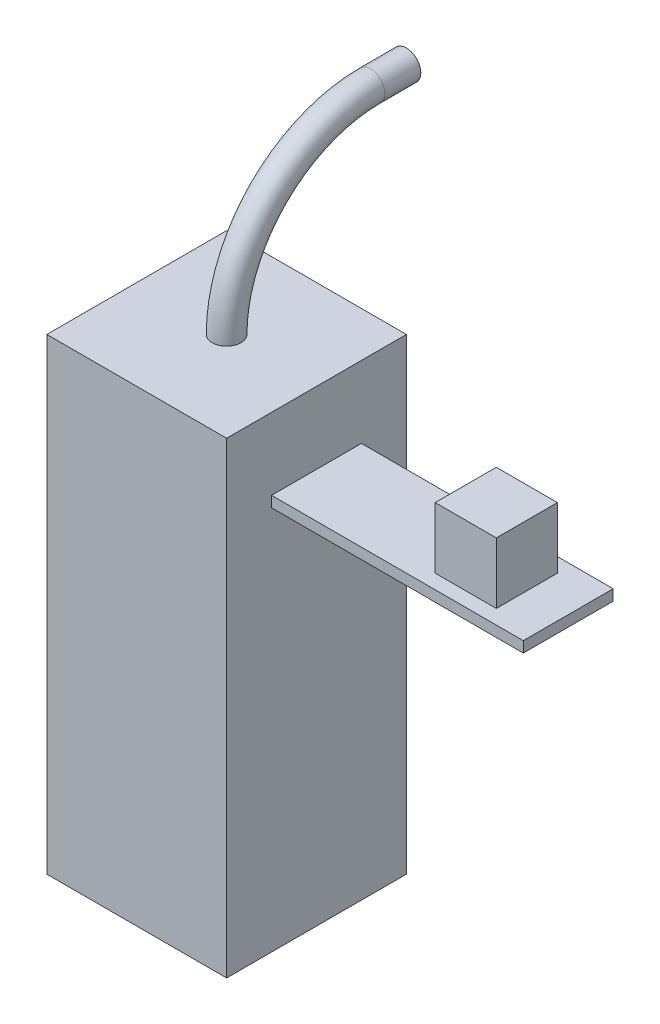
ISO-10303-21;
HEADER;
FILE_DESCRIPTION(('STEP AP214'),'2;1');
FILE_NAME('part.step','',(''),(''),'','','');
FILE_SCHEMA(('AUTOMOTIVE_DESIGN { 1 0 10303 214 1 1 1 1 }'));
ENDSEC;
DATA;
#1=APPLICATION_CONTEXT('core data for automotive mechanical design processes');
#2=APPLICATION_PROTOCOL_DEFINITION('international standard','automotive_design',2000,#1);
#3=PRODUCT_CONTEXT('',#1,'mechanical');
#4=PRODUCT('Part','Part','',(#3));
#5=PRODUCT_RELATED_PRODUCT_CATEGORY('part','',(#4));
#6=PRODUCT_DEFINITION_FORMATION('','',#4);
#7=PRODUCT_DEFINITION_CONTEXT('part definition',#1,'design');
#8=PRODUCT_DEFINITION('design','',#6,#7);
#9=PRODUCT_DEFINITION_SHAPE('','',#8);
#10=(LENGTH_UNIT() NAMED_UNIT(*) SI_UNIT(.MILLI.,.METRE.));
#11=(NAMED_UNIT(*) PLANE_ANGLE_UNIT() SI_UNIT($,.RADIAN.));
#12=(NAMED_UNIT(*) SI_UNIT($,.STERADIAN.) SOLID_ANGLE_UNIT());
#13=UNCERTAINTY_MEASURE_WITH_UNIT(LENGTH_MEASURE(1.E-05),#10,'distance_accuracy_value','');
#14=(GEOMETRIC_REPRESENTATION_CONTEXT(3) GLOBAL_UNCERTAINTY_ASSIGNED_CONTEXT((#13)) GLOBAL_UNIT_ASSIGNED_CONTEXT((#10,
#11,#12)) REPRESENTATION_CONTEXT('',''));
#15=CARTESIAN_POINT('',(0.,0.,0.));
#16=DIRECTION('',(0.,0.,1.));
#17=DIRECTION('',(1.,0.,0.));
#18=AXIS2_PLACEMENT_3D('',#15,#16,#17);
#19=CARTESIAN_POINT('',(95.,110.,12.5));
#20=DIRECTION('',(0.,-1.,0.));
#21=DIRECTION('',(0.,0.,-1.));
#22=AXIS2_PLACEMENT_3D('',#19,#20,#21);
#23=PLANE('',#22);
#24=DIRECTION('',(0.,0.,1.));
#25=VECTOR('',#24,1.);
#26=CARTESIAN_POINT('',(25.,110.,12.5000000000001));
#27=LINE('',#26,#25);
#28=CARTESIAN_POINT('',(25.,110.,-12.5));
#29=VERTEX_POINT('',#28);
#30=CARTESIAN_POINT('',(25.,110.,12.5));
#31=VERTEX_POINT('',#30);
#32=EDGE_CURVE('E173',#29,#31,#27,.T.);
#33=ORIENTED_EDGE('',*,*,#32,.T.);
#34=DIRECTION('',(-1.,0.,0.));
#35=VECTOR('',#34,1.);
#36=CARTESIAN_POINT('',(95.,110.,12.5));
#37=LINE('',#36,#35);
#38=CARTESIAN_POINT('',(95.,110.,12.5));
#39=VERTEX_POINT('',#38);
#40=EDGE_CURVE('E186',#39,#31,#37,.T.);
#41=ORIENTED_EDGE('',*,*,#40,.F.);
#42=DIRECTION('',(0.,0.,1.));
#43=VECTOR('',#42,1.);
#44=CARTESIAN_POINT('',(95.,110.,12.5));
#45=LINE('',#44,#43);
#46=CARTESIAN_POINT('',(95.,110.,-12.5));
#47=VERTEX_POINT('',#46);
#48=EDGE_CURVE('E163',#47,#39,#45,.T.);
#49=ORIENTED_EDGE('',*,*,#48,.F.);
#50=DIRECTION('',(-1.,0.,0.));
#51=VECTOR('',#50,1.);
#52=CARTESIAN_POINT('',(95.,110.,-12.5));
#53=LINE('',#52,#51);
#54=EDGE_CURVE('E189',#47,#29,#53,.T.);
#55=ORIENTED_EDGE('',*,*,#54,.T.);
#56=EDGE_LOOP('',(#33,#41,#49,#55));
#57=FACE_BOUND('',#56,.T.);
#58=DIRECTION('',(0.,0.,1.));
#59=VECTOR('',#58,1.);
#60=CARTESIAN_POINT('',(66.5,110.,-8.5));
#61=LINE('',#60,#59);
#62=CARTESIAN_POINT('',(66.5,110.,-8.5));
#63=VERTEX_POINT('',#62);
#64=CARTESIAN_POINT('',(66.5,110.,8.5));
#65=VERTEX_POINT('',#64);
#66=EDGE_CURVE('E126',#63,#65,#61,.T.);
#67=ORIENTED_EDGE('',*,*,#66,.F.);
#68=DIRECTION('',(-1.,0.,0.));
#69=VECTOR('',#68,1.);
#70=CARTESIAN_POINT('',(83.5,110.,-8.5));
#71=LINE('',#70,#69);
#72=CARTESIAN_POINT('',(83.5,110.,-8.5));
#73=VERTEX_POINT('',#72);
#74=EDGE_CURVE('E138',#73,#63,#71,.T.);
#75=ORIENTED_EDGE('',*,*,#74,.F.);
#76=DIRECTION('',(0.,0.,-1.));
#77=VECTOR('',#76,1.);
#78=CARTESIAN_POINT('',(83.5,110.,-8.5));
#79=LINE('',#78,#77);
#80=CARTESIAN_POINT('',(83.5,110.,8.5));
#81=VERTEX_POINT('',#80);
#82=EDGE_CURVE('E54',#81,#73,#79,.T.);
#83=ORIENTED_EDGE('',*,*,#82,.F.);
#84=DIRECTION('',(1.,0.,0.));
#85=VECTOR('',#84,1.);
#86=CARTESIAN_POINT('',(83.5,110.,8.5));
#87=LINE('',#86,#85);
#88=EDGE_CURVE('E49',#65,#81,#87,.T.);
#89=ORIENTED_EDGE('',*,*,#88,.F.);
#90=EDGE_LOOP('',(#67,#75,#83,#89));
#91=FACE_BOUND('',#90,.T.);
#92=ADVANCED_FACE('F33',(#57,#91),#23,.F.);
#93=CARTESIAN_POINT('',(25.,130.,-25.));
#94=DIRECTION('',(-1.,0.,0.));
#95=DIRECTION('',(0.,0.,1.));
#96=AXIS2_PLACEMENT_3D('',#93,#94,#95);
#97=PLANE('',#96);
#98=DIRECTION('',(0.,0.,-1.));
#99=VECTOR('',#98,1.);
#100=CARTESIAN_POINT('',(25.,0.,-25.));
#101=LINE('',#100,#99);
#102=CARTESIAN_POINT('',(25.,0.,25.));
#103=VERTEX_POINT('',#102);
#104=CARTESIAN_POINT('',(25.,0.,-25.));
#105=VERTEX_POINT('',#104);
#106=EDGE_CURVE('E208',#103,#105,#101,.T.);
#107=ORIENTED_EDGE('',*,*,#106,.T.);
#108=DIRECTION('',(0.,-1.,0.));
#109=VECTOR('',#108,1.);
#110=CARTESIAN_POINT('',(25.,130.,-25.));
#111=LINE('',#110,#109);
#112=CARTESIAN_POINT('',(25.,130.,-25.));
#113=VERTEX_POINT('',#112);
#114=EDGE_CURVE('E213',#113,#105,#111,.T.);
#115=ORIENTED_EDGE('',*,*,#114,.F.);
#116=DIRECTION('',(0.,0.,-1.));
#117=VECTOR('',#116,1.);
#118=CARTESIAN_POINT('',(25.,130.,-25.));
#119=LINE('',#118,#117);
#120=CARTESIAN_POINT('',(25.,130.,25.));
#121=VERTEX_POINT('',#120);
#122=EDGE_CURVE('E199',#121,#113,#119,.T.);
#123=ORIENTED_EDGE('',*,*,#122,.F.);
#124=DIRECTION('',(0.,-1.,0.));
#125=VECTOR('',#124,1.);
#126=CARTESIAN_POINT('',(25.,130.,25.));
#127=LINE('',#126,#125);
#128=EDGE_CURVE('E215',#121,#103,#127,.T.);
#129=ORIENTED_EDGE('',*,*,#128,.T.);
#130=EDGE_LOOP('',(#107,#115,#123,#129));
#131=FACE_BOUND('',#130,.T.);
#132=DIRECTION('',(0.,1.,0.));
#133=VECTOR('',#132,1.);
#134=CARTESIAN_POINT('',(25.,110.,-12.4999999999999));
#135=LINE('',#134,#133);
#136=CARTESIAN_POINT('',(25.,107.,-12.5));
#137=VERTEX_POINT('',#136);
#138=EDGE_CURVE('E159',#137,#29,#135,.T.);
#139=ORIENTED_EDGE('',*,*,#138,.F.);
#140=DIRECTION('',(0.,0.,-1.));
#141=VECTOR('',#140,1.);
#142=CARTESIAN_POINT('',(25.,107.,12.5000000000001));
#143=LINE('',#142,#141);
#144=CARTESIAN_POINT('',(25.,107.,12.5000000000001));
#145=VERTEX_POINT('',#144);
#146=EDGE_CURVE('E164',#145,#137,#143,.T.);
#147=ORIENTED_EDGE('',*,*,#146,.F.);
#148=DIRECTION('',(0.,-1.,0.));
#149=VECTOR('',#148,1.);
#150=CARTESIAN_POINT('',(25.,110.,12.5000000000001));
#151=LINE('',#150,#149);
#152=EDGE_CURVE('E176',#31,#145,#151,.T.);
#153=ORIENTED_EDGE('',*,*,#152,.F.);
#154=ORIENTED_EDGE('',*,*,#32,.F.);
#155=EDGE_LOOP('',(#139,#147,#153,#154));
#156=FACE_BOUND('',#155,.T.);
#157=ADVANCED_FACE('F233',(#131,#156),#97,.F.);
#158=CARTESIAN_POINT('',(-25.,130.,-25.));
#159=DIRECTION('',(1.,0.,0.));
#160=DIRECTION('',(0.,0.,-1.));
#161=AXIS2_PLACEMENT_3D('',#158,#159,#160);
#162=PLANE('',#161);
#163=DIRECTION('',(0.,0.,1.));
#164=VECTOR('',#163,1.);
#165=CARTESIAN_POINT('',(-25.,0.,-25.));
#166=LINE('',#165,#164);
#167=CARTESIAN_POINT('',(-25.,0.,-25.));
#168=VERTEX_POINT('',#167);
#169=CARTESIAN_POINT('',(-25.,0.,25.));
#170=VERTEX_POINT('',#169);
#171=EDGE_CURVE('E192',#168,#170,#166,.T.);
#172=ORIENTED_EDGE('',*,*,#171,.T.);
#173=DIRECTION('',(0.,-1.,0.));
#174=VECTOR('',#173,1.);
#175=CARTESIAN_POINT('',(-25.,130.,25.));
#176=LINE('',#175,#174);
#177=CARTESIAN_POINT('',(-25.,130.,25.));
#178=VERTEX_POINT('',#177);
#179=EDGE_CURVE('E37',#178,#170,#176,.T.);
#180=ORIENTED_EDGE('',*,*,#179,.F.);
#181=DIRECTION('',(0.,0.,1.));
#182=VECTOR('',#181,1.);
#183=CARTESIAN_POINT('',(-25.,130.,-25.));
#184=LINE('',#183,#182);
#185=CARTESIAN_POINT('',(-25.,130.,-25.));
#186=VERTEX_POINT('',#185);
#187=EDGE_CURVE('E193',#186,#178,#184,.T.);
#188=ORIENTED_EDGE('',*,*,#187,.F.);
#189=DIRECTION('',(0.,-1.,0.));
#190=VECTOR('',#189,1.);
#191=CARTESIAN_POINT('',(-25.,130.,-25.));
#192=LINE('',#191,#190);
#193=EDGE_CURVE('E203',#186,#168,#192,.T.);
#194=ORIENTED_EDGE('',*,*,#193,.T.);
#195=EDGE_LOOP('',(#172,#180,#188,#194));
#196=FACE_BOUND('',#195,.T.);
#197=ADVANCED_FACE('F35',(#196),#162,.F.);
#198=CARTESIAN_POINT('',(25.,130.,25.));
#199=DIRECTION('',(0.,0.,-1.));
#200=DIRECTION('',(-1.,0.,0.));
#201=AXIS2_PLACEMENT_3D('',#198,#199,#200);
#202=PLANE('',#201);
#203=DIRECTION('',(1.,0.,0.));
#204=VECTOR('',#203,1.);
#205=CARTESIAN_POINT('',(25.,0.,25.));
#206=LINE('',#205,#204);
#207=EDGE_CURVE('E206',#170,#103,#206,.T.);
#208=ORIENTED_EDGE('',*,*,#207,.T.);
#209=ORIENTED_EDGE('',*,*,#128,.F.);
#210=DIRECTION('',(1.,0.,0.));
#211=VECTOR('',#210,1.);
#212=CARTESIAN_POINT('',(25.,130.,25.));
#213=LINE('',#212,#211);
#214=EDGE_CURVE('E196',#178,#121,#213,.T.);
#215=ORIENTED_EDGE('',*,*,#214,.F.);
#216=ORIENTED_EDGE('',*,*,#179,.T.);
#217=EDGE_LOOP('',(#208,#209,#215,#216));
#218=FACE_BOUND('',#217,.T.);
#219=ADVANCED_FACE('F224',(#218),#202,.F.);
#220=CARTESIAN_POINT('',(25.,130.,-25.));
#221=DIRECTION('',(0.,0.,1.));
#222=DIRECTION('',(1.,0.,0.));
#223=AXIS2_PLACEMENT_3D('',#220,#221,#222);
#224=PLANE('',#223);
#225=DIRECTION('',(-1.,0.,0.));
#226=VECTOR('',#225,1.);
#227=CARTESIAN_POINT('',(25.,0.,-25.));
#228=LINE('',#227,#226);
#229=EDGE_CURVE('E197',#105,#168,#228,.T.);
#230=ORIENTED_EDGE('',*,*,#229,.T.);
#231=ORIENTED_EDGE('',*,*,#193,.F.);
#232=DIRECTION('',(-1.,0.,0.));
#233=VECTOR('',#232,1.);
#234=CARTESIAN_POINT('',(25.,130.,-25.));
#235=LINE('',#234,#233);
#236=EDGE_CURVE('E201',#113,#186,#235,.T.);
#237=ORIENTED_EDGE('',*,*,#236,.F.);
#238=ORIENTED_EDGE('',*,*,#114,.T.);
#239=EDGE_LOOP('',(#230,#231,#237,#238));
#240=FACE_BOUND('',#239,.T.);
#241=ADVANCED_FACE('F237',(#240),#224,.F.);
#242=CARTESIAN_POINT('',(0.,130.,0.));
#243=DIRECTION('',(0.,-1.,0.));
#244=DIRECTION('',(0.,0.,-1.));
#245=AXIS2_PLACEMENT_3D('',#242,#243,#244);
#246=PLANE('',#245);
#247=CARTESIAN_POINT('',(0.,130.,0.));
#248=DIRECTION('',(0.,1.,0.));
#249=DIRECTION('',(0.,0.,1.));
#250=AXIS2_PLACEMENT_3D('',#247,#248,#249);
#251=CIRCLE('',#250,4.);
#252=CARTESIAN_POINT('',(0.,130.,4.));
#253=VERTEX_POINT('',#252);
#254=EDGE_CURVE('E11',#253,#253,#251,.T.);
#255=ORIENTED_EDGE('',*,*,#254,.F.);
#256=EDGE_LOOP('',(#255));
#257=FACE_BOUND('',#256,.T.);
#258=ORIENTED_EDGE('',*,*,#187,.T.);
#259=ORIENTED_EDGE('',*,*,#214,.T.);
#260=ORIENTED_EDGE('',*,*,#122,.T.);
#261=ORIENTED_EDGE('',*,*,#236,.T.);
#262=EDGE_LOOP('',(#258,#259,#260,#261));
#263=FACE_BOUND('',#262,.T.);
#264=ADVANCED_FACE('F239',(#257,#263),#246,.F.);
#265=CARTESIAN_POINT('',(0.,0.,0.));
#266=DIRECTION('',(0.,-1.,0.));
#267=DIRECTION('',(0.,0.,-1.));
#268=AXIS2_PLACEMENT_3D('',#265,#266,#267);
#269=PLANE('',#268);
#270=ORIENTED_EDGE('',*,*,#171,.F.);
#271=ORIENTED_EDGE('',*,*,#229,.F.);
#272=ORIENTED_EDGE('',*,*,#106,.F.);
#273=ORIENTED_EDGE('',*,*,#207,.F.);
#274=EDGE_LOOP('',(#270,#271,#272,#273));
#275=FACE_BOUND('',#274,.T.);
#276=ADVANCED_FACE('F231',(#275),#269,.T.);
#277=CARTESIAN_POINT('',(95.,110.,-12.5));
#278=DIRECTION('',(0.,0.,1.));
#279=DIRECTION('',(0.,-1.,0.));
#280=AXIS2_PLACEMENT_3D('',#277,#278,#279);
#281=PLANE('',#280);
#282=ORIENTED_EDGE('',*,*,#138,.T.);
#283=ORIENTED_EDGE('',*,*,#54,.F.);
#284=DIRECTION('',(0.,1.,0.));
#285=VECTOR('',#284,1.);
#286=CARTESIAN_POINT('',(95.,110.,-12.5));
#287=LINE('',#286,#285);
#288=CARTESIAN_POINT('',(95.,107.,-12.5));
#289=VERTEX_POINT('',#288);
#290=EDGE_CURVE('E160',#289,#47,#287,.T.);
#291=ORIENTED_EDGE('',*,*,#290,.F.);
#292=DIRECTION('',(-1.,0.,0.));
#293=VECTOR('',#292,1.);
#294=CARTESIAN_POINT('',(95.,107.,-12.5));
#295=LINE('',#294,#293);
#296=EDGE_CURVE('E170',#289,#137,#295,.T.);
#297=ORIENTED_EDGE('',*,*,#296,.T.);
#298=EDGE_LOOP('',(#282,#283,#291,#297));
#299=FACE_BOUND('',#298,.T.);
#300=ADVANCED_FACE('F247',(#299),#281,.F.);
#301=CARTESIAN_POINT('',(95.,110.,12.5));
#302=DIRECTION('',(0.,0.,-1.));
#303=DIRECTION('',(0.,1.,0.));
#304=AXIS2_PLACEMENT_3D('',#301,#302,#303);
#305=PLANE('',#304);
#306=ORIENTED_EDGE('',*,*,#152,.T.);
#307=DIRECTION('',(-1.,0.,0.));
#308=VECTOR('',#307,1.);
#309=CARTESIAN_POINT('',(95.,107.,12.5));
#310=LINE('',#309,#308);
#311=CARTESIAN_POINT('',(95.,107.,12.5));
#312=VERTEX_POINT('',#311);
#313=EDGE_CURVE('E183',#312,#145,#310,.T.);
#314=ORIENTED_EDGE('',*,*,#313,.F.);
#315=DIRECTION('',(0.,-1.,0.));
#316=VECTOR('',#315,1.);
#317=CARTESIAN_POINT('',(95.,110.,12.5));
#318=LINE('',#317,#316);
#319=EDGE_CURVE('E166',#39,#312,#318,.T.);
#320=ORIENTED_EDGE('',*,*,#319,.F.);
#321=ORIENTED_EDGE('',*,*,#40,.T.);
#322=EDGE_LOOP('',(#306,#314,#320,#321));
#323=FACE_BOUND('',#322,.T.);
#324=ADVANCED_FACE('F260',(#323),#305,.F.);
#325=CARTESIAN_POINT('',(95.,107.,12.5));
#326=DIRECTION('',(0.,1.,0.));
#327=DIRECTION('',(0.,0.,1.));
#328=AXIS2_PLACEMENT_3D('',#325,#326,#327);
#329=PLANE('',#328);
#330=ORIENTED_EDGE('',*,*,#146,.T.);
#331=ORIENTED_EDGE('',*,*,#296,.F.);
#332=DIRECTION('',(0.,0.,-1.));
#333=VECTOR('',#332,1.);
#334=CARTESIAN_POINT('',(95.,107.,12.5));
#335=LINE('',#334,#333);
#336=EDGE_CURVE('E168',#312,#289,#335,.T.);
#337=ORIENTED_EDGE('',*,*,#336,.F.);
#338=ORIENTED_EDGE('',*,*,#313,.T.);
#339=EDGE_LOOP('',(#330,#331,#337,#338));
#340=FACE_BOUND('',#339,.T.);
#341=ADVANCED_FACE('F267',(#340),#329,.F.);
#342=CARTESIAN_POINT('',(95.,0.,0.));
#343=DIRECTION('',(1.,0.,0.));
#344=DIRECTION('',(0.,0.,-1.));
#345=AXIS2_PLACEMENT_3D('',#342,#343,#344);
#346=PLANE('',#345);
#347=ORIENTED_EDGE('',*,*,#290,.T.);
#348=ORIENTED_EDGE('',*,*,#48,.T.);
#349=ORIENTED_EDGE('',*,*,#319,.T.);
#350=ORIENTED_EDGE('',*,*,#336,.T.);
#351=EDGE_LOOP('',(#347,#348,#349,#350));
#352=FACE_BOUND('',#351,.T.);
#353=ADVANCED_FACE('F278',(#352),#346,.T.);
#354=CARTESIAN_POINT('',(66.5,127.,-8.5));
#355=DIRECTION('',(1.,0.,0.));
#356=DIRECTION('',(0.,0.,-1.));
#357=AXIS2_PLACEMENT_3D('',#354,#355,#356);
#358=PLANE('',#357);
#359=ORIENTED_EDGE('',*,*,#66,.T.);
#360=DIRECTION('',(0.,-1.,0.));
#361=VECTOR('',#360,1.);
#362=CARTESIAN_POINT('',(66.5,127.,8.5));
#363=LINE('',#362,#361);
#364=CARTESIAN_POINT('',(66.5,127.,8.5));
#365=VERTEX_POINT('',#364);
#366=EDGE_CURVE('E157',#365,#65,#363,.T.);
#367=ORIENTED_EDGE('',*,*,#366,.F.);
#368=DIRECTION('',(0.,0.,1.));
#369=VECTOR('',#368,1.);
#370=CARTESIAN_POINT('',(66.5,127.,-8.5));
#371=LINE('',#370,#369);
#372=CARTESIAN_POINT('',(66.5,127.,-8.5));
#373=VERTEX_POINT('',#372);
#374=EDGE_CURVE('E134',#373,#365,#371,.T.);
#375=ORIENTED_EDGE('',*,*,#374,.F.);
#376=DIRECTION('',(0.,-1.,0.));
#377=VECTOR('',#376,1.);
#378=CARTESIAN_POINT('',(66.5,127.,-8.5));
#379=LINE('',#378,#377);
#380=EDGE_CURVE('E143',#373,#63,#379,.T.);
#381=ORIENTED_EDGE('',*,*,#380,.T.);
#382=EDGE_LOOP('',(#359,#367,#375,#381));
#383=FACE_BOUND('',#382,.T.);
#384=ADVANCED_FACE('F280',(#383),#358,.F.);
#385=CARTESIAN_POINT('',(83.5,127.,8.5));
#386=DIRECTION('',(0.,0.,-1.));
#387=DIRECTION('',(-1.,0.,0.));
#388=AXIS2_PLACEMENT_3D('',#385,#386,#387);
#389=PLANE('',#388);
#390=ORIENTED_EDGE('',*,*,#88,.T.);
#391=DIRECTION('',(0.,-1.,0.));
#392=VECTOR('',#391,1.);
#393=CARTESIAN_POINT('',(83.5,127.,8.5));
#394=LINE('',#393,#392);
#395=CARTESIAN_POINT('',(83.5,127.,8.5));
#396=VERTEX_POINT('',#395);
#397=EDGE_CURVE('E154',#396,#81,#394,.T.);
#398=ORIENTED_EDGE('',*,*,#397,.F.);
#399=DIRECTION('',(1.,0.,0.));
#400=VECTOR('',#399,1.);
#401=CARTESIAN_POINT('',(83.5,127.,8.5));
#402=LINE('',#401,#400);
#403=EDGE_CURVE('E137',#365,#396,#402,.T.);
#404=ORIENTED_EDGE('',*,*,#403,.F.);
#405=ORIENTED_EDGE('',*,*,#366,.T.);
#406=EDGE_LOOP('',(#390,#398,#404,#405));
#407=FACE_BOUND('',#406,.T.);
#408=ADVANCED_FACE('F286',(#407),#389,.F.);
#409=CARTESIAN_POINT('',(83.5,127.,-8.5));
#410=DIRECTION('',(-1.,0.,0.));
#411=DIRECTION('',(0.,0.,1.));
#412=AXIS2_PLACEMENT_3D('',#409,#410,#411);
#413=PLANE('',#412);
#414=ORIENTED_EDGE('',*,*,#82,.T.);
#415=DIRECTION('',(0.,-1.,0.));
#416=VECTOR('',#415,1.);
#417=CARTESIAN_POINT('',(83.5,127.,-8.5));
#418=LINE('',#417,#416);
#419=CARTESIAN_POINT('',(83.5,127.,-8.5));
#420=VERTEX_POINT('',#419);
#421=EDGE_CURVE('E151',#420,#73,#418,.T.);
#422=ORIENTED_EDGE('',*,*,#421,.F.);
#423=DIRECTION('',(0.,0.,-1.));
#424=VECTOR('',#423,1.);
#425=CARTESIAN_POINT('',(83.5,127.,-8.5));
#426=LINE('',#425,#424);
#427=EDGE_CURVE('E140',#396,#420,#426,.T.);
#428=ORIENTED_EDGE('',*,*,#427,.F.);
#429=ORIENTED_EDGE('',*,*,#397,.T.);
#430=EDGE_LOOP('',(#414,#422,#428,#429));
#431=FACE_BOUND('',#430,.T.);
#432=ADVANCED_FACE('F292',(#431),#413,.F.);
#433=CARTESIAN_POINT('',(83.5,127.,-8.5));
#434=DIRECTION('',(0.,0.,1.));
#435=DIRECTION('',(1.,0.,0.));
#436=AXIS2_PLACEMENT_3D('',#433,#434,#435);
#437=PLANE('',#436);
#438=ORIENTED_EDGE('',*,*,#74,.T.);
#439=ORIENTED_EDGE('',*,*,#380,.F.);
#440=DIRECTION('',(-1.,0.,0.));
#441=VECTOR('',#440,1.);
#442=CARTESIAN_POINT('',(83.5,127.,-8.5));
#443=LINE('',#442,#441);
#444=EDGE_CURVE('E142',#420,#373,#443,.T.);
#445=ORIENTED_EDGE('',*,*,#444,.F.);
#446=ORIENTED_EDGE('',*,*,#421,.T.);
#447=EDGE_LOOP('',(#438,#439,#445,#446));
#448=FACE_BOUND('',#447,.T.);
#449=ADVANCED_FACE('F296',(#448),#437,.F.);
#450=CARTESIAN_POINT('',(0.,127.,0.));
#451=DIRECTION('',(0.,-1.,0.));
#452=DIRECTION('',(0.,0.,-1.));
#453=AXIS2_PLACEMENT_3D('',#450,#451,#452);
#454=PLANE('',#453);
#455=ORIENTED_EDGE('',*,*,#374,.T.);
#456=ORIENTED_EDGE('',*,*,#403,.T.);
#457=ORIENTED_EDGE('',*,*,#427,.T.);
#458=ORIENTED_EDGE('',*,*,#444,.T.);
#459=EDGE_LOOP('',(#455,#456,#457,#458));
#460=FACE_BOUND('',#459,.T.);
#461=ADVANCED_FACE('F300',(#460),#454,.F.);
#462=CARTESIAN_POINT('',(0.,170.,-50.));
#463=DIRECTION('',(0.,0.,-1.));
#464=DIRECTION('',(0.,1.,0.));
#465=AXIS2_PLACEMENT_3D('',#462,#463,#464);
#466=PLANE('',#465);
#467=CARTESIAN_POINT('',(0.,170.,-50.));
#468=DIRECTION('',(0.,0.,-1.));
#469=DIRECTION('',(0.,1.,0.));
#470=AXIS2_PLACEMENT_3D('',#467,#468,#469);
#471=CIRCLE('',#470,4.);
#472=CARTESIAN_POINT('',(0.,174.,-50.));
#473=VERTEX_POINT('',#472);
#474=EDGE_CURVE('E123',#473,#473,#471,.T.);
#475=ORIENTED_EDGE('',*,*,#474,.T.);
#476=EDGE_LOOP('',(#475));
#477=FACE_BOUND('',#476,.T.);
#478=ADVANCED_FACE('F124',(#477),#466,.T.);
#479=CARTESIAN_POINT('',(0.,130.,-40.));
#480=DIRECTION('',(-1.,0.,0.));
#481=DIRECTION('',(0.,0.,1.));
#482=AXIS2_PLACEMENT_3D('',#479,#480,#481);
#483=TOROIDAL_SURFACE('',#482,40.,4.);
#484=CARTESIAN_POINT('',(0.,170.,-40.));
#485=DIRECTION('',(0.,0.,-1.));
#486=DIRECTION('',(0.,1.,0.));
#487=AXIS2_PLACEMENT_3D('',#484,#485,#486);
#488=CIRCLE('',#487,4.);
#489=CARTESIAN_POINT('',(0.,174.,-40.));
#490=VERTEX_POINT('',#489);
#491=EDGE_CURVE('E127',#490,#490,#488,.T.);
#492=CARTESIAN_POINT('',(0.,130.,-40.));
#493=DIRECTION('',(-1.,0.,0.));
#494=DIRECTION('',(0.,0.,1.));
#495=AXIS2_PLACEMENT_3D('',#492,#493,#494);
#496=CIRCLE('',#495,44.);
#497=EDGE_CURVE('',#253,#490,#496,.T.);
#498=ORIENTED_EDGE('',*,*,#254,.T.);
#499=ORIENTED_EDGE('',*,*,#491,.F.);
#500=ORIENTED_EDGE('',*,*,#497,.T.);
#501=ORIENTED_EDGE('',*,*,#497,.F.);
#502=EDGE_LOOP('',(#498,#500,#499,#501));
#503=FACE_BOUND('',#502,.T.);
#504=ADVANCED_FACE('F308',(#503),#483,.T.);
#505=CARTESIAN_POINT('',(0.,170.,-40.));
#506=DIRECTION('',(0.,0.,-1.));
#507=DIRECTION('',(-1.,0.,0.));
#508=AXIS2_PLACEMENT_3D('',#505,#506,#507);
#509=CYLINDRICAL_SURFACE('',#508,4.);
#510=ORIENTED_EDGE('',*,*,#474,.F.);
#511=EDGE_LOOP('',(#510));
#512=FACE_BOUND('',#511,.T.);
#513=ORIENTED_EDGE('',*,*,#491,.T.);
#514=EDGE_LOOP('',(#513));
#515=FACE_BOUND('',#514,.T.);
#516=ADVANCED_FACE('F305',(#512,#515),#509,.T.);
#517=CLOSED_SHELL('',(#92,#157,#197,#219,#241,#264,#276,#300,#324,#341,#353,#384,#408,#432,#449,
#461,#478,#504,#516));
#518=MANIFOLD_SOLID_BREP('B2',#517);
#519=ADVANCED_BREP_SHAPE_REPRESENTATION('',(#18,#518),#14);
#520=SHAPE_DEFINITION_REPRESENTATION(#9,#519);
ENDSEC;
END-ISO-10303-21;
